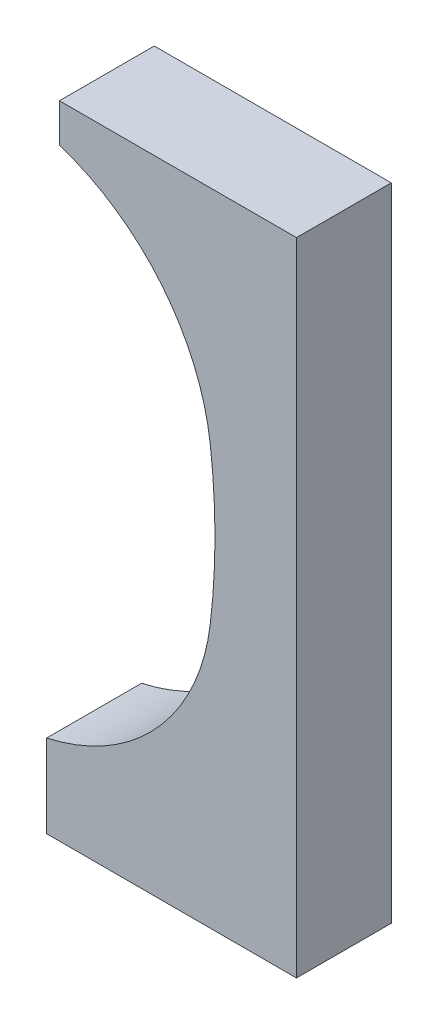
ISO-10303-21;
HEADER;
FILE_DESCRIPTION(('STEP AP214'),'2;1');
FILE_NAME('part.step','',(''),(''),'','','');
FILE_SCHEMA(('AUTOMOTIVE_DESIGN { 1 0 10303 214 1 1 1 1 }'));
ENDSEC;
DATA;
#1=APPLICATION_CONTEXT('core data for automotive mechanical design processes');
#2=APPLICATION_PROTOCOL_DEFINITION('international standard','automotive_design',2000,#1);
#3=PRODUCT_CONTEXT('',#1,'mechanical');
#4=PRODUCT('Part','Part','',(#3));
#5=PRODUCT_RELATED_PRODUCT_CATEGORY('part','',(#4));
#6=PRODUCT_DEFINITION_FORMATION('','',#4);
#7=PRODUCT_DEFINITION_CONTEXT('part definition',#1,'design');
#8=PRODUCT_DEFINITION('design','',#6,#7);
#9=PRODUCT_DEFINITION_SHAPE('','',#8);
#10=(LENGTH_UNIT() NAMED_UNIT(*) SI_UNIT(.MILLI.,.METRE.));
#11=(NAMED_UNIT(*) PLANE_ANGLE_UNIT() SI_UNIT($,.RADIAN.));
#12=(NAMED_UNIT(*) SI_UNIT($,.STERADIAN.) SOLID_ANGLE_UNIT());
#13=UNCERTAINTY_MEASURE_WITH_UNIT(LENGTH_MEASURE(1.E-05),#10,'distance_accuracy_value','');
#14=(GEOMETRIC_REPRESENTATION_CONTEXT(3) GLOBAL_UNCERTAINTY_ASSIGNED_CONTEXT((#13)) GLOBAL_UNIT_ASSIGNED_CONTEXT((#10,
#11,#12)) REPRESENTATION_CONTEXT('',''));
#15=CARTESIAN_POINT('',(0.,0.,0.));
#16=DIRECTION('',(0.,0.,1.));
#17=DIRECTION('',(1.,0.,0.));
#18=AXIS2_PLACEMENT_3D('',#15,#16,#17);
#19=CARTESIAN_POINT('',(-160.202692117469,87.1623802847704,32.));
#20=DIRECTION('',(0.,0.,-1.));
#21=DIRECTION('',(-1.,0.,0.));
#22=AXIS2_PLACEMENT_3D('',#19,#20,#21);
#23=CYLINDRICAL_SURFACE('',#22,217.);
#24=CARTESIAN_POINT('',(-160.202692117469,87.1623802847704,0.));
#25=DIRECTION('',(0.,0.,-1.));
#26=DIRECTION('',(1.,0.,0.));
#27=AXIS2_PLACEMENT_3D('',#24,#25,#26);
#28=CIRCLE('',#27,217.);
#29=CARTESIAN_POINT('',(55.1731421815533,113.66238028477,0.));
#30=VERTEX_POINT('',#29);
#31=CARTESIAN_POINT('',(55.1731421815533,60.6623802847704,0.));
#32=VERTEX_POINT('',#31);
#33=EDGE_CURVE('E143',#30,#32,#28,.T.);
#34=ORIENTED_EDGE('',*,*,#33,.T.);
#35=DIRECTION('',(0.,0.,-1.));
#36=VECTOR('',#35,1.);
#37=CARTESIAN_POINT('',(55.1731421815533,60.6623802847704,32.));
#38=LINE('',#37,#36);
#39=CARTESIAN_POINT('',(55.1731421815533,60.6623802847704,32.));
#40=VERTEX_POINT('',#39);
#41=EDGE_CURVE('E11',#40,#32,#38,.T.);
#42=ORIENTED_EDGE('',*,*,#41,.F.);
#43=CARTESIAN_POINT('',(-160.202692117469,87.1623802847704,32.));
#44=DIRECTION('',(0.,0.,-1.));
#45=DIRECTION('',(1.,0.,0.));
#46=AXIS2_PLACEMENT_3D('',#43,#44,#45);
#47=CIRCLE('',#46,217.);
#48=CARTESIAN_POINT('',(55.1731421815533,113.66238028477,32.));
#49=VERTEX_POINT('',#48);
#50=EDGE_CURVE('E166',#49,#40,#47,.T.);
#51=ORIENTED_EDGE('',*,*,#50,.F.);
#52=DIRECTION('',(0.,0.,-1.));
#53=VECTOR('',#52,1.);
#54=CARTESIAN_POINT('',(55.1731421815533,113.66238028477,32.));
#55=LINE('',#54,#53);
#56=EDGE_CURVE('E139',#49,#30,#55,.T.);
#57=ORIENTED_EDGE('',*,*,#56,.T.);
#58=EDGE_LOOP('',(#34,#42,#51,#57));
#59=FACE_BOUND('',#58,.T.);
#60=ADVANCED_FACE('F42',(#59),#23,.F.);
#61=CARTESIAN_POINT('',(-15.2954487642098,69.3328871972128,32.));
#62=DIRECTION('',(0.,0.,-1.));
#63=DIRECTION('',(-1.,0.,0.));
#64=AXIS2_PLACEMENT_3D('',#61,#62,#63);
#65=CYLINDRICAL_SURFACE('',#64,71.);
#66=CARTESIAN_POINT('',(-15.2954487642098,69.3328871972128,0.));
#67=DIRECTION('',(0.,0.,-1.));
#68=DIRECTION('',(1.,0.,0.));
#69=AXIS2_PLACEMENT_3D('',#66,#67,#68);
#70=CIRCLE('',#69,71.);
#71=CARTESIAN_POINT('',(0.,0.,0.));
#72=VERTEX_POINT('',#71);
#73=EDGE_CURVE('E147',#32,#72,#70,.T.);
#74=ORIENTED_EDGE('',*,*,#73,.T.);
#75=DIRECTION('',(0.,0.,-1.));
#76=VECTOR('',#75,1.);
#77=CARTESIAN_POINT('',(0.,0.,32.));
#78=LINE('',#77,#76);
#79=CARTESIAN_POINT('',(0.,0.,32.));
#80=VERTEX_POINT('',#79);
#81=EDGE_CURVE('E51',#80,#72,#78,.T.);
#82=ORIENTED_EDGE('',*,*,#81,.F.);
#83=CARTESIAN_POINT('',(-15.2954487642098,69.3328871972128,32.));
#84=DIRECTION('',(0.,0.,-1.));
#85=DIRECTION('',(1.,0.,0.));
#86=AXIS2_PLACEMENT_3D('',#83,#84,#85);
#87=CIRCLE('',#86,71.);
#88=EDGE_CURVE('E102',#40,#80,#87,.T.);
#89=ORIENTED_EDGE('',*,*,#88,.F.);
#90=ORIENTED_EDGE('',*,*,#41,.T.);
#91=EDGE_LOOP('',(#74,#82,#89,#90));
#92=FACE_BOUND('',#91,.T.);
#93=ADVANCED_FACE('F211',(#92),#65,.F.);
#94=CARTESIAN_POINT('',(0.,0.,32.));
#95=DIRECTION('',(1.,0.,0.));
#96=DIRECTION('',(0.,0.,-1.));
#97=AXIS2_PLACEMENT_3D('',#94,#95,#96);
#98=PLANE('',#97);
#99=DIRECTION('',(0.,-1.,0.));
#100=VECTOR('',#99,1.);
#101=CARTESIAN_POINT('',(0.,0.,0.));
#102=LINE('',#101,#100);
#103=CARTESIAN_POINT('',(0.,-28.,0.));
#104=VERTEX_POINT('',#103);
#105=EDGE_CURVE('E150',#72,#104,#102,.T.);
#106=ORIENTED_EDGE('',*,*,#105,.T.);
#107=DIRECTION('',(0.,0.,-1.));
#108=VECTOR('',#107,1.);
#109=CARTESIAN_POINT('',(0.,-28.,32.));
#110=LINE('',#109,#108);
#111=CARTESIAN_POINT('',(0.,-28.,32.));
#112=VERTEX_POINT('',#111);
#113=EDGE_CURVE('E177',#112,#104,#110,.T.);
#114=ORIENTED_EDGE('',*,*,#113,.F.);
#115=DIRECTION('',(0.,-1.,0.));
#116=VECTOR('',#115,1.);
#117=CARTESIAN_POINT('',(0.,0.,32.));
#118=LINE('',#117,#116);
#119=EDGE_CURVE('E187',#80,#112,#118,.T.);
#120=ORIENTED_EDGE('',*,*,#119,.F.);
#121=ORIENTED_EDGE('',*,*,#81,.T.);
#122=EDGE_LOOP('',(#106,#114,#120,#121));
#123=FACE_BOUND('',#122,.T.);
#124=ADVANCED_FACE('F185',(#123),#98,.F.);
#125=CARTESIAN_POINT('',(84.2996185309478,-28.,32.));
#126=DIRECTION('',(0.,1.,0.));
#127=DIRECTION('',(0.,0.,1.));
#128=AXIS2_PLACEMENT_3D('',#125,#126,#127);
#129=PLANE('',#128);
#130=DIRECTION('',(1.,0.,0.));
#131=VECTOR('',#130,1.);
#132=CARTESIAN_POINT('',(84.2996185309478,-28.,0.));
#133=LINE('',#132,#131);
#134=CARTESIAN_POINT('',(84.2996185309478,-28.,0.));
#135=VERTEX_POINT('',#134);
#136=EDGE_CURVE('E153',#104,#135,#133,.T.);
#137=ORIENTED_EDGE('',*,*,#136,.T.);
#138=DIRECTION('',(0.,0.,-1.));
#139=VECTOR('',#138,1.);
#140=CARTESIAN_POINT('',(84.2996185309478,-28.,32.));
#141=LINE('',#140,#139);
#142=CARTESIAN_POINT('',(84.2996185309478,-28.,32.));
#143=VERTEX_POINT('',#142);
#144=EDGE_CURVE('E173',#143,#135,#141,.T.);
#145=ORIENTED_EDGE('',*,*,#144,.F.);
#146=DIRECTION('',(1.,0.,0.));
#147=VECTOR('',#146,1.);
#148=CARTESIAN_POINT('',(84.2996185309478,-28.,32.));
#149=LINE('',#148,#147);
#150=EDGE_CURVE('E199',#112,#143,#149,.T.);
#151=ORIENTED_EDGE('',*,*,#150,.F.);
#152=ORIENTED_EDGE('',*,*,#113,.T.);
#153=EDGE_LOOP('',(#137,#145,#151,#152));
#154=FACE_BOUND('',#153,.T.);
#155=ADVANCED_FACE('F194',(#154),#129,.F.);
#156=CARTESIAN_POINT('',(84.2996185309478,175.402841826382,32.));
#157=DIRECTION('',(-1.,0.,0.));
#158=DIRECTION('',(0.,0.,1.));
#159=AXIS2_PLACEMENT_3D('',#156,#157,#158);
#160=PLANE('',#159);
#161=DIRECTION('',(0.,1.,0.));
#162=VECTOR('',#161,1.);
#163=CARTESIAN_POINT('',(84.2996185309478,175.402841826382,0.));
#164=LINE('',#163,#162);
#165=CARTESIAN_POINT('',(84.2996185309478,188.402841826382,0.));
#166=VERTEX_POINT('',#165);
#167=EDGE_CURVE('E157',#135,#166,#164,.T.);
#168=ORIENTED_EDGE('',*,*,#167,.T.);
#169=DIRECTION('',(0.,0.,-1.));
#170=VECTOR('',#169,1.);
#171=CARTESIAN_POINT('',(84.2996185309478,188.402841826382,32.));
#172=LINE('',#171,#170);
#173=CARTESIAN_POINT('',(84.2996185309478,188.402841826382,32.));
#174=VERTEX_POINT('',#173);
#175=EDGE_CURVE('E132',#174,#166,#172,.T.);
#176=ORIENTED_EDGE('',*,*,#175,.F.);
#177=DIRECTION('',(0.,1.,0.));
#178=VECTOR('',#177,1.);
#179=CARTESIAN_POINT('',(84.2996185309478,0.,32.));
#180=LINE('',#179,#178);
#181=EDGE_CURVE('E121',#143,#174,#180,.T.);
#182=ORIENTED_EDGE('',*,*,#181,.F.);
#183=ORIENTED_EDGE('',*,*,#144,.T.);
#184=EDGE_LOOP('',(#168,#176,#182,#183));
#185=FACE_BOUND('',#184,.T.);
#186=ADVANCED_FACE('F197',(#185),#160,.F.);
#187=CARTESIAN_POINT('',(84.2996185309478,188.402841826382,32.));
#188=DIRECTION('',(0.,-1.,0.));
#189=DIRECTION('',(0.,0.,-1.));
#190=AXIS2_PLACEMENT_3D('',#187,#188,#189);
#191=PLANE('',#190);
#192=DIRECTION('',(-1.,0.,0.));
#193=VECTOR('',#192,1.);
#194=CARTESIAN_POINT('',(84.2996185309478,188.402841826382,0.));
#195=LINE('',#194,#193);
#196=CARTESIAN_POINT('',(4.29961853094774,188.402841826382,0.));
#197=VERTEX_POINT('',#196);
#198=EDGE_CURVE('E130',#166,#197,#195,.T.);
#199=ORIENTED_EDGE('',*,*,#198,.T.);
#200=DIRECTION('',(0.,0.,-1.));
#201=VECTOR('',#200,1.);
#202=CARTESIAN_POINT('',(4.29961853094774,188.402841826382,32.));
#203=LINE('',#202,#201);
#204=CARTESIAN_POINT('',(4.29961853094774,188.402841826382,32.));
#205=VERTEX_POINT('',#204);
#206=EDGE_CURVE('E127',#205,#197,#203,.T.);
#207=ORIENTED_EDGE('',*,*,#206,.F.);
#208=DIRECTION('',(-1.,0.,0.));
#209=VECTOR('',#208,1.);
#210=CARTESIAN_POINT('',(84.2996185309478,188.402841826382,32.));
#211=LINE('',#210,#209);
#212=EDGE_CURVE('E115',#174,#205,#211,.T.);
#213=ORIENTED_EDGE('',*,*,#212,.F.);
#214=ORIENTED_EDGE('',*,*,#175,.T.);
#215=EDGE_LOOP('',(#199,#207,#213,#214));
#216=FACE_BOUND('',#215,.T.);
#217=ADVANCED_FACE('F128',(#216),#191,.F.);
#218=CARTESIAN_POINT('',(4.29961853094774,175.402841826382,32.));
#219=DIRECTION('',(1.,0.,0.));
#220=DIRECTION('',(0.,0.,-1.));
#221=AXIS2_PLACEMENT_3D('',#218,#219,#220);
#222=PLANE('',#221);
#223=DIRECTION('',(0.,-1.,0.));
#224=VECTOR('',#223,1.);
#225=CARTESIAN_POINT('',(4.29961853094774,175.402841826382,0.));
#226=LINE('',#225,#224);
#227=CARTESIAN_POINT('',(4.29961853094774,175.402841826382,0.));
#228=VERTEX_POINT('',#227);
#229=EDGE_CURVE('E88',#197,#228,#226,.T.);
#230=ORIENTED_EDGE('',*,*,#229,.T.);
#231=DIRECTION('',(0.,0.,-1.));
#232=VECTOR('',#231,1.);
#233=CARTESIAN_POINT('',(4.29961853094774,175.402841826382,32.));
#234=LINE('',#233,#232);
#235=CARTESIAN_POINT('',(4.29961853094774,175.402841826382,32.));
#236=VERTEX_POINT('',#235);
#237=EDGE_CURVE('E133',#236,#228,#234,.T.);
#238=ORIENTED_EDGE('',*,*,#237,.F.);
#239=DIRECTION('',(0.,-1.,0.));
#240=VECTOR('',#239,1.);
#241=CARTESIAN_POINT('',(4.29961853094774,175.402841826382,32.));
#242=LINE('',#241,#240);
#243=EDGE_CURVE('E119',#205,#236,#242,.T.);
#244=ORIENTED_EDGE('',*,*,#243,.F.);
#245=ORIENTED_EDGE('',*,*,#206,.T.);
#246=EDGE_LOOP('',(#230,#238,#244,#245));
#247=FACE_BOUND('',#246,.T.);
#248=ADVANCED_FACE('F135',(#247),#222,.F.);
#249=CARTESIAN_POINT('',(-18.7692525432263,104.564454017489,32.));
#250=DIRECTION('',(0.,0.,-1.));
#251=DIRECTION('',(-1.,0.,0.));
#252=AXIS2_PLACEMENT_3D('',#249,#250,#251);
#253=CYLINDRICAL_SURFACE('',#252,74.5);
#254=CARTESIAN_POINT('',(-18.7692525432263,104.564454017489,0.));
#255=DIRECTION('',(0.,0.,-1.));
#256=DIRECTION('',(1.,0.,0.));
#257=AXIS2_PLACEMENT_3D('',#254,#255,#256);
#258=CIRCLE('',#257,74.5);
#259=EDGE_CURVE('E94',#228,#30,#258,.T.);
#260=ORIENTED_EDGE('',*,*,#259,.T.);
#261=ORIENTED_EDGE('',*,*,#56,.F.);
#262=CARTESIAN_POINT('',(-18.7692525432263,104.564454017489,32.));
#263=DIRECTION('',(0.,0.,-1.));
#264=DIRECTION('',(1.,0.,0.));
#265=AXIS2_PLACEMENT_3D('',#262,#263,#264);
#266=CIRCLE('',#265,74.5);
#267=EDGE_CURVE('E59',#236,#49,#266,.T.);
#268=ORIENTED_EDGE('',*,*,#267,.F.);
#269=ORIENTED_EDGE('',*,*,#237,.T.);
#270=EDGE_LOOP('',(#260,#261,#268,#269));
#271=FACE_BOUND('',#270,.T.);
#272=ADVANCED_FACE('F227',(#271),#253,.F.);
#273=CARTESIAN_POINT('',(-160.202692117469,87.1623802847704,32.));
#274=DIRECTION('',(0.,0.,1.));
#275=DIRECTION('',(1.,0.,0.));
#276=AXIS2_PLACEMENT_3D('',#273,#274,#275);
#277=PLANE('',#276);
#278=ORIENTED_EDGE('',*,*,#50,.T.);
#279=ORIENTED_EDGE('',*,*,#88,.T.);
#280=ORIENTED_EDGE('',*,*,#119,.T.);
#281=ORIENTED_EDGE('',*,*,#150,.T.);
#282=ORIENTED_EDGE('',*,*,#181,.T.);
#283=ORIENTED_EDGE('',*,*,#212,.T.);
#284=ORIENTED_EDGE('',*,*,#243,.T.);
#285=ORIENTED_EDGE('',*,*,#267,.T.);
#286=EDGE_LOOP('',(#278,#279,#280,#281,#282,#283,#284,#285));
#287=FACE_BOUND('',#286,.T.);
#288=ADVANCED_FACE('F117',(#287),#277,.T.);
#289=CARTESIAN_POINT('',(-160.202692117469,87.1623802847704,0.));
#290=DIRECTION('',(0.,0.,1.));
#291=DIRECTION('',(1.,0.,0.));
#292=AXIS2_PLACEMENT_3D('',#289,#290,#291);
#293=PLANE('',#292);
#294=ORIENTED_EDGE('',*,*,#33,.F.);
#295=ORIENTED_EDGE('',*,*,#259,.F.);
#296=ORIENTED_EDGE('',*,*,#229,.F.);
#297=ORIENTED_EDGE('',*,*,#198,.F.);
#298=ORIENTED_EDGE('',*,*,#167,.F.);
#299=ORIENTED_EDGE('',*,*,#136,.F.);
#300=ORIENTED_EDGE('',*,*,#105,.F.);
#301=ORIENTED_EDGE('',*,*,#73,.F.);
#302=EDGE_LOOP('',(#294,#295,#296,#297,#298,#299,#300,#301));
#303=FACE_BOUND('',#302,.T.);
#304=ADVANCED_FACE('F191',(#303),#293,.F.);
#305=CLOSED_SHELL('',(#60,#93,#124,#155,#186,#217,#248,#272,#288,#304));
#306=MANIFOLD_SOLID_BREP('B2',#305);
#307=ADVANCED_BREP_SHAPE_REPRESENTATION('',(#18,#306),#14);
#308=SHAPE_DEFINITION_REPRESENTATION(#9,#307);
ENDSEC;
END-ISO-10303-21;
